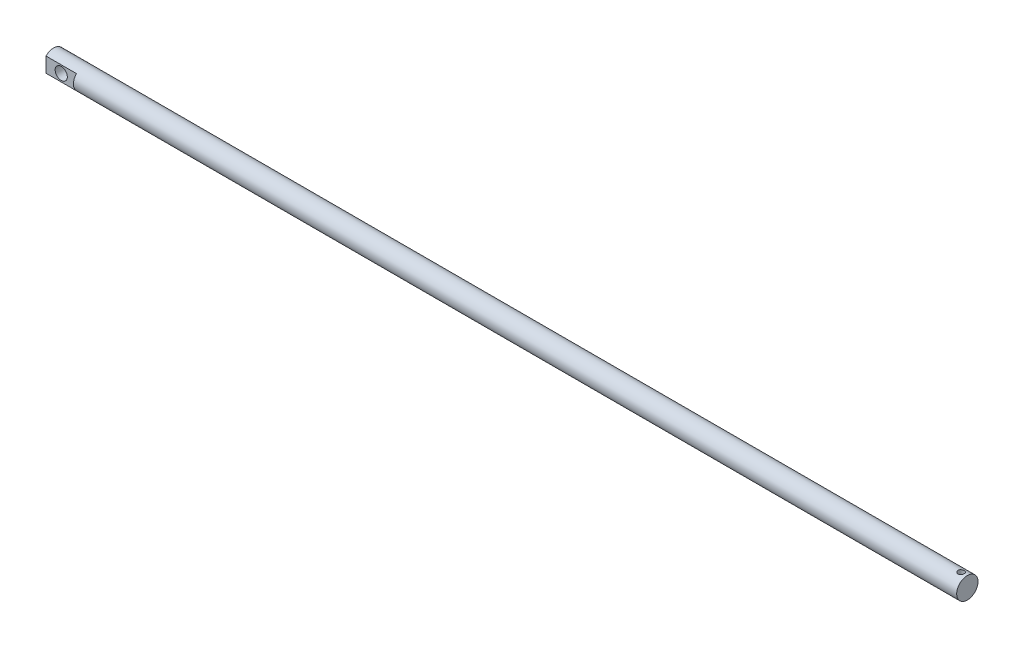
ISO-10303-21;
HEADER;
FILE_DESCRIPTION(('STEP AP214'),'2;1');
FILE_NAME('part.step','',(''),(''),'','','');
FILE_SCHEMA(('AUTOMOTIVE_DESIGN { 1 0 10303 214 1 1 1 1 }'));
ENDSEC;
DATA;
#1=APPLICATION_CONTEXT('core data for automotive mechanical design processes');
#2=APPLICATION_PROTOCOL_DEFINITION('international standard','automotive_design',2000,#1);
#3=PRODUCT_CONTEXT('',#1,'mechanical');
#4=PRODUCT('Part','Part','',(#3));
#5=PRODUCT_RELATED_PRODUCT_CATEGORY('part','',(#4));
#6=PRODUCT_DEFINITION_FORMATION('','',#4);
#7=PRODUCT_DEFINITION_CONTEXT('part definition',#1,'design');
#8=PRODUCT_DEFINITION('design','',#6,#7);
#9=PRODUCT_DEFINITION_SHAPE('','',#8);
#10=(LENGTH_UNIT() NAMED_UNIT(*) SI_UNIT(.MILLI.,.METRE.));
#11=(NAMED_UNIT(*) PLANE_ANGLE_UNIT() SI_UNIT($,.RADIAN.));
#12=(NAMED_UNIT(*) SI_UNIT($,.STERADIAN.) SOLID_ANGLE_UNIT());
#13=UNCERTAINTY_MEASURE_WITH_UNIT(LENGTH_MEASURE(1.E-05),#10,'distance_accuracy_value','');
#14=(GEOMETRIC_REPRESENTATION_CONTEXT(3) GLOBAL_UNCERTAINTY_ASSIGNED_CONTEXT((#13)) GLOBAL_UNIT_ASSIGNED_CONTEXT((#10,
#11,#12)) REPRESENTATION_CONTEXT('',''));
#15=CARTESIAN_POINT('',(0.,0.,0.));
#16=DIRECTION('',(0.,0.,1.));
#17=DIRECTION('',(1.,0.,0.));
#18=AXIS2_PLACEMENT_3D('',#15,#16,#17);
#19=CARTESIAN_POINT('',(600.,0.,0.));
#20=DIRECTION('',(-1.,0.,0.));
#21=DIRECTION('',(0.,0.,1.));
#22=AXIS2_PLACEMENT_3D('',#19,#20,#21);
#23=CYLINDRICAL_SURFACE('',#22,7.);
#24=CARTESIAN_POINT('',(593.999999999999,-7.,0.));
#25=CARTESIAN_POINT('',(594.000001939561,-6.99999869294341,0.109954902377268));
#26=CARTESIAN_POINT('',(594.009097788976,-6.99738417402043,0.219929747872615));
#27=CARTESIAN_POINT('',(594.045164270102,-6.98720905945103,0.436691991197052));
#28=CARTESIAN_POINT('',(594.072141666074,-6.97964659210084,0.543478166829692));
#29=CARTESIAN_POINT('',(594.143008038416,-6.96040691349072,0.75070430073796));
#30=CARTESIAN_POINT('',(594.186873436151,-6.9487354410634,0.851152880848314));
#31=CARTESIAN_POINT('',(594.290177991478,-6.92249978316542,1.04326876112939));
#32=CARTESIAN_POINT('',(594.34961877849,-6.9079352950802,1.1349351411783));
#33=CARTESIAN_POINT('',(594.484035010672,-6.87704734625576,1.30929444685912));
#34=CARTESIAN_POINT('',(594.559344753855,-6.86069041945187,1.39172372238114));
#35=CARTESIAN_POINT('',(594.722647743137,-6.82826734915636,1.54297135792458));
#36=CARTESIAN_POINT('',(594.810642887632,-6.81220124959338,1.61178767707806));
#37=CARTESIAN_POINT('',(594.99899358279,-6.78183014875381,1.73519790006457));
#38=CARTESIAN_POINT('',(595.099561985064,-6.7675670250601,1.78947821103377));
#39=CARTESIAN_POINT('',(595.30887201175,-6.74291343840659,1.8802517055401));
#40=CARTESIAN_POINT('',(595.417611872071,-6.73252214244863,1.91674871555749));
#41=CARTESIAN_POINT('',(595.637234763165,-6.71713608196007,1.96998433013906));
#42=CARTESIAN_POINT('',(595.747991362767,-6.71200978570002,1.98720553202881));
#43=CARTESIAN_POINT('',(595.970931148446,-6.70734208201985,2.00290667789217));
#44=CARTESIAN_POINT('',(596.08311401925,-6.70779946107602,2.00139069409654));
#45=CARTESIAN_POINT('',(596.301868611456,-6.71413034409924,1.98004134762936));
#46=CARTESIAN_POINT('',(596.408504351181,-6.71982782697927,1.96080325728423));
#47=CARTESIAN_POINT('',(596.616967219627,-6.73571348382802,1.9055138608582));
#48=CARTESIAN_POINT('',(596.71879391272,-6.74590206376395,1.8694610348128));
#49=CARTESIAN_POINT('',(596.916246244432,-6.76976863516072,1.78110681137842));
#50=CARTESIAN_POINT('',(597.011777072402,-6.78348916405641,1.72860551172911));
#51=CARTESIAN_POINT('',(597.192876561213,-6.81285216882052,1.60898379167916));
#52=CARTESIAN_POINT('',(597.278442997735,-6.82849507221905,1.54186011673376));
#53=CARTESIAN_POINT('',(597.440572375606,-6.8606625065635,1.3919039967305));
#54=CARTESIAN_POINT('',(597.516674475967,-6.87719804572361,1.30857487484559));
#55=CARTESIAN_POINT('',(597.65392600364,-6.90876247218341,1.13013228238645));
#56=CARTESIAN_POINT('',(597.715074656042,-6.92379128137822,1.03501820148211));
#57=CARTESIAN_POINT('',(597.820928734774,-6.95076528065499,0.834923073091647));
#58=CARTESIAN_POINT('',(597.865540286804,-6.96269275497227,0.729889817810184));
#59=CARTESIAN_POINT('',(597.936333891417,-6.98199251487584,0.513393229967602));
#60=CARTESIAN_POINT('',(597.962520589245,-6.98936594856255,0.401931525810254));
#61=CARTESIAN_POINT('',(597.99497328571,-6.99854874514672,0.179666388644417));
#62=CARTESIAN_POINT('',(598.001864695373,-7.00053272850599,0.0689613468605594));
#63=CARTESIAN_POINT('',(597.997272733699,-6.99922084707091,-0.152026526805571));
#64=CARTESIAN_POINT('',(597.985791567154,-6.99592561580629,-0.262309407757119));
#65=CARTESIAN_POINT('',(597.945289555684,-6.98453926685206,-0.477018633430354));
#66=CARTESIAN_POINT('',(597.916626818677,-6.97654613017679,-0.581518211734887));
#67=CARTESIAN_POINT('',(597.842999498015,-6.95667998741883,-0.784208686205712));
#68=CARTESIAN_POINT('',(597.798033029111,-6.94480653265873,-0.882398851248811));
#69=CARTESIAN_POINT('',(597.691976663355,-6.91809961169143,-1.07204168512015));
#70=CARTESIAN_POINT('',(597.630558801175,-6.90320763178338,-1.16330248654021));
#71=CARTESIAN_POINT('',(597.493747494049,-6.87217947098438,-1.33443852805963));
#72=CARTESIAN_POINT('',(597.418350869935,-6.85604300755104,-1.41431117084322));
#73=CARTESIAN_POINT('',(597.252790657951,-6.82368619629438,-1.56310642834029));
#74=CARTESIAN_POINT('',(597.162224724441,-6.807480368583,-1.63158542740736));
#75=CARTESIAN_POINT('',(596.970537411375,-6.7773889473478,-1.75239531606781));
#76=CARTESIAN_POINT('',(596.869416399229,-6.76350327310601,-1.80472676748696));
#77=CARTESIAN_POINT('',(596.659908789025,-6.73978651242828,-1.89137454118307));
#78=CARTESIAN_POINT('',(596.551564236502,-6.72993400029426,-1.92578633239682));
#79=CARTESIAN_POINT('',(596.330290064425,-6.71542456669517,-1.975794500679));
#80=CARTESIAN_POINT('',(596.217361844924,-6.71076607094357,-1.99139657901618));
#81=CARTESIAN_POINT('',(595.994703967063,-6.70731703127609,-2.00298024246883));
#82=CARTESIAN_POINT('',(595.885014495443,-6.70831160808093,-1.99968027644437));
#83=CARTESIAN_POINT('',(595.667825269338,-6.71554597206092,-1.97524710957499));
#84=CARTESIAN_POINT('',(595.560325441908,-6.72178558421104,-1.95411450379907));
#85=CARTESIAN_POINT('',(595.351621628831,-6.73866977160517,-1.8950596881671));
#86=CARTESIAN_POINT('',(595.250364612989,-6.74926877048965,-1.85731091786399));
#87=CARTESIAN_POINT('',(595.055541265507,-6.77367302842104,-1.76622949301612));
#88=CARTESIAN_POINT('',(594.961976298726,-6.78747885482384,-1.71289408043182));
#89=CARTESIAN_POINT('',(594.781816478194,-6.81731668949928,-1.59006546534855));
#90=CARTESIAN_POINT('',(594.695558608658,-6.83340763179058,-1.52009227722758));
#91=CARTESIAN_POINT('',(594.53577610419,-6.86569845092227,-1.36685984037957));
#92=CARTESIAN_POINT('',(594.462254680889,-6.88189835417164,-1.28359725072877));
#93=CARTESIAN_POINT('',(594.328162815673,-6.91307959572361,-1.10357432086559));
#94=CARTESIAN_POINT('',(594.26797301273,-6.9280190103741,-1.00652250235999));
#95=CARTESIAN_POINT('',(594.164854214978,-6.95451395777968,-0.803250529646877));
#96=CARTESIAN_POINT('',(594.121915788067,-6.96607133870285,-0.697035424114947));
#97=CARTESIAN_POINT('',(594.059152448604,-6.98327344725306,-0.492916315335206));
#98=CARTESIAN_POINT('',(594.037026463315,-6.98949684362076,-0.395763007624532));
#99=CARTESIAN_POINT('',(594.007450342757,-6.99786043852147,-0.199078368786442));
#100=CARTESIAN_POINT('',(593.999998244023,-7.00000118333996,-0.0995473576161286));
#101=CARTESIAN_POINT('',(593.999999999999,-7.,0.));
#102=B_SPLINE_CURVE_WITH_KNOTS('',3,(#24,#25,#26,#27,#28,#29,#30,#31,#32,#33,#34,#35,#36,#37,
#38,#39,#40,#41,#42,#43,#44,#45,#46,#47,#48,#49,#50,#51,#52,#53,#54,#55,#56,#57,#58,#59,#60,#61,
#62,#63,#64,#65,#66,#67,#68,#69,#70,#71,#72,#73,#74,#75,#76,#77,#78,#79,#80,#81,#82,#83,#84,#85,
#86,#87,#88,#89,#90,#91,#92,#93,#94,#95,#96,#97,#98,#99,#100,#101),.UNSPECIFIED.,.T.,.F.,(4,2,2,
2,2,2,2,2,2,2,2,2,2,2,2,2,2,2,2,2,2,2,2,2,2,2,2,2,2,2,2,2,2,2,2,2,2,2,4),(0.,0.329499312542394,
0.659123339795276,0.988288812895436,1.31748873543533,1.65447811530804,1.99151797873739,
2.33533075300099,2.6790695154485,3.0139950986279,3.34884789231284,3.67284785829393,
3.99687711786186,4.32500803291267,4.65321205577406,4.99378500602575,5.33437560155527,
5.67687101104534,6.01928004014705,6.35045457698299,6.68158937434751,7.00605140479629,
7.33055096575641,7.66207525344566,7.99367503187908,8.33612104884465,8.6785551496543,
9.01914573366266,9.35963305787878,9.68726681616629,10.0148896418612,10.3391709629142,
10.6635096999774,10.9986765689054,11.3339278310866,11.6777797897034,12.0214434923427,
12.3197946803814,12.6181059442792),.UNSPECIFIED.);
#103=CARTESIAN_POINT('',(593.999999999999,-7.,0.));
#104=VERTEX_POINT('',#103);
#105=EDGE_CURVE('E12',#104,#104,#102,.T.);
#106=ORIENTED_EDGE('',*,*,#105,.T.);
#107=EDGE_LOOP('',(#106));
#108=FACE_BOUND('',#107,.T.);
#109=CARTESIAN_POINT('',(593.999999999999,6.99999999999974,0.));
#110=CARTESIAN_POINT('',(594.000001939561,6.99999869294314,-0.109954902377272));
#111=CARTESIAN_POINT('',(594.009097788976,6.99738417402035,-0.219929747872623));
#112=CARTESIAN_POINT('',(594.045164270102,6.9872090594511,-0.436691991197063));
#113=CARTESIAN_POINT('',(594.072141666074,6.97964659210085,-0.543478166829702));
#114=CARTESIAN_POINT('',(594.143008038416,6.9604069134907,-0.75070430073797));
#115=CARTESIAN_POINT('',(594.186873436151,6.94873544106339,-0.851152880848326));
#116=CARTESIAN_POINT('',(594.290177991478,6.92249978316542,-1.04326876112941));
#117=CARTESIAN_POINT('',(594.34961877849,6.9079352950802,-1.13493514117833));
#118=CARTESIAN_POINT('',(594.484035010672,6.87704734625576,-1.30929444685915));
#119=CARTESIAN_POINT('',(594.559344753855,6.86069041945186,-1.39172372238116));
#120=CARTESIAN_POINT('',(594.722647743137,6.82826734915636,-1.54297135792458));
#121=CARTESIAN_POINT('',(594.810642887632,6.81220124959338,-1.61178767707807));
#122=CARTESIAN_POINT('',(594.99899358279,6.78183014875381,-1.73519790006457));
#123=CARTESIAN_POINT('',(595.099561985064,6.7675670250601,-1.78947821103377));
#124=CARTESIAN_POINT('',(595.30887201175,6.74291343840659,-1.8802517055401));
#125=CARTESIAN_POINT('',(595.417611872071,6.73252214244863,-1.91674871555749));
#126=CARTESIAN_POINT('',(595.637234763165,6.71713608196007,-1.96998433013906));
#127=CARTESIAN_POINT('',(595.747991362767,6.71200978570002,-1.98720553202881));
#128=CARTESIAN_POINT('',(595.970931148446,6.70734208201985,-2.00290667789217));
#129=CARTESIAN_POINT('',(596.08311401925,6.70779946107602,-2.00139069409653));
#130=CARTESIAN_POINT('',(596.301868611456,6.71413034409924,-1.98004134762935));
#131=CARTESIAN_POINT('',(596.408504351181,6.71982782697927,-1.96080325728423));
#132=CARTESIAN_POINT('',(596.616967219627,6.73571348382802,-1.9055138608582));
#133=CARTESIAN_POINT('',(596.71879391272,6.74590206376395,-1.8694610348128));
#134=CARTESIAN_POINT('',(596.916246244432,6.76976863516072,-1.78110681137842));
#135=CARTESIAN_POINT('',(597.011777072402,6.78348916405641,-1.72860551172912));
#136=CARTESIAN_POINT('',(597.192876561213,6.81285216882052,-1.60898379167915));
#137=CARTESIAN_POINT('',(597.278442997735,6.82849507221905,-1.54186011673376));
#138=CARTESIAN_POINT('',(597.440572375606,6.86066250656349,-1.39190399673052));
#139=CARTESIAN_POINT('',(597.516674475967,6.8771980457236,-1.30857487484563));
#140=CARTESIAN_POINT('',(597.65392600364,6.9087624721834,-1.13013228238649));
#141=CARTESIAN_POINT('',(597.715074656042,6.92379128137822,-1.03501820148213));
#142=CARTESIAN_POINT('',(597.820928734774,6.95076528065499,-0.834923073091639));
#143=CARTESIAN_POINT('',(597.865540286804,6.96269275497227,-0.729889817810179));
#144=CARTESIAN_POINT('',(597.936333891417,6.98199251487584,-0.513393229967596));
#145=CARTESIAN_POINT('',(597.962520589245,6.98936594856255,-0.401931525810245));
#146=CARTESIAN_POINT('',(597.99497328571,6.99854874514672,-0.179666388644405));
#147=CARTESIAN_POINT('',(598.001864695373,7.00053272850599,-0.068961346860546));
#148=CARTESIAN_POINT('',(597.997272733699,6.99922084707091,0.152026526805586));
#149=CARTESIAN_POINT('',(597.985791567154,6.99592561580629,0.262309407757136));
#150=CARTESIAN_POINT('',(597.945289555684,6.98453926685206,0.477018633430373));
#151=CARTESIAN_POINT('',(597.916626818677,6.97654613017679,0.581518211734908));
#152=CARTESIAN_POINT('',(597.842999498015,6.95667998741882,0.784208686205738));
#153=CARTESIAN_POINT('',(597.798033029111,6.94480653265872,0.882398851248841));
#154=CARTESIAN_POINT('',(597.691976663355,6.91809961169143,1.07204168512018));
#155=CARTESIAN_POINT('',(597.630558801175,6.90320763178338,1.16330248654023));
#156=CARTESIAN_POINT('',(597.493747494049,6.87217947098438,1.33443852805964));
#157=CARTESIAN_POINT('',(597.418350869935,6.85604300755104,1.41431117084323));
#158=CARTESIAN_POINT('',(597.252790657951,6.82368619629438,1.56310642834029));
#159=CARTESIAN_POINT('',(597.162224724441,6.80748036858299,1.63158542740736));
#160=CARTESIAN_POINT('',(596.970537411375,6.7773889473478,1.75239531606781));
#161=CARTESIAN_POINT('',(596.869416399229,6.76350327310601,1.80472676748696));
#162=CARTESIAN_POINT('',(596.659908789025,6.73978651242828,1.89137454118307));
#163=CARTESIAN_POINT('',(596.551564236502,6.72993400029426,1.92578633239682));
#164=CARTESIAN_POINT('',(596.330290064425,6.71542456669517,1.975794500679));
#165=CARTESIAN_POINT('',(596.217361844924,6.71076607094357,1.99139657901618));
#166=CARTESIAN_POINT('',(595.994703967063,6.70731703127609,2.00298024246883));
#167=CARTESIAN_POINT('',(595.885014495443,6.70831160808093,1.99968027644437));
#168=CARTESIAN_POINT('',(595.667825269338,6.71554597206093,1.97524710957498));
#169=CARTESIAN_POINT('',(595.560325441908,6.72178558421105,1.95411450379904));
#170=CARTESIAN_POINT('',(595.351621628831,6.73866977160519,1.89505968816704));
#171=CARTESIAN_POINT('',(595.250364612988,6.74926877048966,1.85731091786393));
#172=CARTESIAN_POINT('',(595.055541265507,6.77367302842105,1.76622949301608));
#173=CARTESIAN_POINT('',(594.961976298726,6.78747885482385,1.7128940804318));
#174=CARTESIAN_POINT('',(594.781816478194,6.81731668949928,1.59006546534855));
#175=CARTESIAN_POINT('',(594.695558608658,6.83340763179058,1.52009227722757));
#176=CARTESIAN_POINT('',(594.53577610419,6.86569845092227,1.36685984037957));
#177=CARTESIAN_POINT('',(594.462254680889,6.88189835417164,1.28359725072877));
#178=CARTESIAN_POINT('',(594.328162815673,6.91307959572362,1.10357432086557));
#179=CARTESIAN_POINT('',(594.26797301273,6.92801901037411,1.00652250235994));
#180=CARTESIAN_POINT('',(594.164854214978,6.95451395777969,0.803250529646806));
#181=CARTESIAN_POINT('',(594.121915788067,6.96607133870284,0.697035424114884));
#182=CARTESIAN_POINT('',(594.059152448604,6.98327344725309,0.492916315335162));
#183=CARTESIAN_POINT('',(594.037026463315,6.98949684362082,0.3957630076245));
#184=CARTESIAN_POINT('',(594.007450342757,6.99786043852141,0.199078368786428));
#185=CARTESIAN_POINT('',(593.999998244023,7.00000118333971,0.0995473576161219));
#186=CARTESIAN_POINT('',(593.999999999999,6.99999999999974,0.));
#187=B_SPLINE_CURVE_WITH_KNOTS('',3,(#109,#110,#111,#112,#113,#114,#115,#116,#117,#118,#119,
#120,#121,#122,#123,#124,#125,#126,#127,#128,#129,#130,#131,#132,#133,#134,#135,#136,#137,#138,
#139,#140,#141,#142,#143,#144,#145,#146,#147,#148,#149,#150,#151,#152,#153,#154,#155,#156,#157,
#158,#159,#160,#161,#162,#163,#164,#165,#166,#167,#168,#169,#170,#171,#172,#173,#174,#175,#176,
#177,#178,#179,#180,#181,#182,#183,#184,#185,#186),.UNSPECIFIED.,.T.,.F.,(4,2,2,2,2,2,2,2,2,2,2,
2,2,2,2,2,2,2,2,2,2,2,2,2,2,2,2,2,2,2,2,2,2,2,2,2,2,2,4),(0.,0.329499312542399,
0.659123339795279,0.988288812895446,1.31748873543536,1.65447811530804,1.99151797873739,
2.33533075300099,2.6790695154485,3.0139950986279,3.34884789231284,3.67284785829393,
3.99687711786186,4.32500803291267,4.65321205577406,4.99378500602571,5.33437560155527,
5.67687101104535,6.01928004014706,6.350454576983,6.68158937434753,7.00605140479632,
7.33055096575645,7.66207525344567,7.99367503187909,8.33612104884466,8.67855514965431,
9.01914573366267,9.35963305787879,9.6872668161663,10.0148896418615,10.3391709629144,
10.6635096999775,10.9986765689054,11.3339278310866,11.6777797897035,12.0214434923427,
12.3197946803814,12.6181059442792),.UNSPECIFIED.);
#188=CARTESIAN_POINT('',(593.999999999999,6.99999999999974,0.));
#189=VERTEX_POINT('',#188);
#190=EDGE_CURVE('E47',#189,#189,#187,.T.);
#191=ORIENTED_EDGE('',*,*,#190,.T.);
#192=EDGE_LOOP('',(#191));
#193=FACE_BOUND('',#192,.T.);
#194=CARTESIAN_POINT('',(600.,0.,0.));
#195=DIRECTION('',(1.,0.,0.));
#196=DIRECTION('',(0.,0.,-1.));
#197=AXIS2_PLACEMENT_3D('',#194,#195,#196);
#198=CIRCLE('',#197,7.);
#199=CARTESIAN_POINT('',(600.,0.,-7.));
#200=VERTEX_POINT('',#199);
#201=EDGE_CURVE('E89',#200,#200,#198,.T.);
#202=ORIENTED_EDGE('',*,*,#201,.F.);
#203=EDGE_LOOP('',(#202));
#204=FACE_BOUND('',#203,.T.);
#205=DIRECTION('',(-1.,0.,0.));
#206=VECTOR('',#205,1.);
#207=CARTESIAN_POINT('',(600.,4.89897948556636,5.));
#208=LINE('',#207,#206);
#209=CARTESIAN_POINT('',(20.,4.89897948556636,5.));
#210=VERTEX_POINT('',#209);
#211=CARTESIAN_POINT('',(0.,4.89897948556636,5.));
#212=VERTEX_POINT('',#211);
#213=EDGE_CURVE('E62',#210,#212,#208,.T.);
#214=ORIENTED_EDGE('',*,*,#213,.F.);
#215=CARTESIAN_POINT('',(20.,0.,0.));
#216=DIRECTION('',(-1.,0.,0.));
#217=DIRECTION('',(0.,0.,1.));
#218=AXIS2_PLACEMENT_3D('',#215,#216,#217);
#219=CIRCLE('',#218,7.);
#220=CARTESIAN_POINT('',(20.,-4.89897948556635,5.));
#221=VERTEX_POINT('',#220);
#222=EDGE_CURVE('E107',#221,#210,#219,.T.);
#223=ORIENTED_EDGE('',*,*,#222,.F.);
#224=DIRECTION('',(-1.,0.,0.));
#225=VECTOR('',#224,1.);
#226=CARTESIAN_POINT('',(600.,-4.89897948556635,5.));
#227=LINE('',#226,#225);
#228=CARTESIAN_POINT('',(0.,-4.89897948556635,5.));
#229=VERTEX_POINT('',#228);
#230=EDGE_CURVE('E208',#229,#221,#227,.F.);
#231=ORIENTED_EDGE('',*,*,#230,.F.);
#232=CARTESIAN_POINT('',(0.,0.,0.));
#233=DIRECTION('',(1.,0.,0.));
#234=DIRECTION('',(0.,0.,-1.));
#235=AXIS2_PLACEMENT_3D('',#232,#233,#234);
#236=CIRCLE('',#235,7.);
#237=CARTESIAN_POINT('',(0.,-4.89897948556636,-5.));
#238=VERTEX_POINT('',#237);
#239=EDGE_CURVE('E99',#229,#238,#236,.T.);
#240=ORIENTED_EDGE('',*,*,#239,.T.);
#241=DIRECTION('',(-1.,0.,0.));
#242=VECTOR('',#241,1.);
#243=CARTESIAN_POINT('',(600.,-4.89897948556636,-5.));
#244=LINE('',#243,#242);
#245=CARTESIAN_POINT('',(20.,-4.89897948556636,-5.));
#246=VERTEX_POINT('',#245);
#247=EDGE_CURVE('E54',#246,#238,#244,.T.);
#248=ORIENTED_EDGE('',*,*,#247,.F.);
#249=CARTESIAN_POINT('',(20.,4.89897948556636,-5.));
#250=VERTEX_POINT('',#249);
#251=EDGE_CURVE('E95',#250,#246,#219,.T.);
#252=ORIENTED_EDGE('',*,*,#251,.F.);
#253=DIRECTION('',(-1.,0.,0.));
#254=VECTOR('',#253,1.);
#255=CARTESIAN_POINT('',(600.,4.89897948556636,-5.));
#256=LINE('',#255,#254);
#257=CARTESIAN_POINT('',(0.,4.89897948556636,-5.));
#258=VERTEX_POINT('',#257);
#259=EDGE_CURVE('E82',#258,#250,#256,.F.);
#260=ORIENTED_EDGE('',*,*,#259,.F.);
#261=EDGE_CURVE('E94',#258,#212,#236,.T.);
#262=ORIENTED_EDGE('',*,*,#261,.T.);
#263=EDGE_LOOP('',(#214,#223,#231,#240,#248,#252,#260,#262));
#264=FACE_BOUND('',#263,.T.);
#265=ADVANCED_FACE('F36',(#108,#193,#204,#264),#23,.T.);
#266=CARTESIAN_POINT('',(0.,0.,0.));
#267=DIRECTION('',(1.,0.,0.));
#268=DIRECTION('',(0.,0.,-1.));
#269=AXIS2_PLACEMENT_3D('',#266,#267,#268);
#270=PLANE('',#269);
#271=DIRECTION('',(0.,-1.,0.));
#272=VECTOR('',#271,1.);
#273=CARTESIAN_POINT('',(0.,0.,5.));
#274=LINE('',#273,#272);
#275=EDGE_CURVE('E88',#212,#229,#274,.T.);
#276=ORIENTED_EDGE('',*,*,#275,.F.);
#277=ORIENTED_EDGE('',*,*,#261,.F.);
#278=DIRECTION('',(0.,1.,0.));
#279=VECTOR('',#278,1.);
#280=CARTESIAN_POINT('',(0.,0.,-5.));
#281=LINE('',#280,#279);
#282=EDGE_CURVE('E79',#238,#258,#281,.T.);
#283=ORIENTED_EDGE('',*,*,#282,.F.);
#284=ORIENTED_EDGE('',*,*,#239,.F.);
#285=EDGE_LOOP('',(#276,#277,#283,#284));
#286=FACE_BOUND('',#285,.T.);
#287=ADVANCED_FACE('F98',(#286),#270,.F.);
#288=CARTESIAN_POINT('',(600.,0.,0.));
#289=DIRECTION('',(1.,0.,0.));
#290=DIRECTION('',(0.,0.,-1.));
#291=AXIS2_PLACEMENT_3D('',#288,#289,#290);
#292=PLANE('',#291);
#293=ORIENTED_EDGE('',*,*,#201,.T.);
#294=EDGE_LOOP('',(#293));
#295=FACE_BOUND('',#294,.T.);
#296=ADVANCED_FACE('F129',(#295),#292,.T.);
#297=CARTESIAN_POINT('',(20.,10.,-5.));
#298=DIRECTION('',(0.,0.,-1.));
#299=DIRECTION('',(0.,1.,0.));
#300=AXIS2_PLACEMENT_3D('',#297,#298,#299);
#301=PLANE('',#300);
#302=CARTESIAN_POINT('',(10.,0.,-5.));
#303=DIRECTION('',(0.,0.,-1.));
#304=DIRECTION('',(0.,1.,0.));
#305=AXIS2_PLACEMENT_3D('',#302,#303,#304);
#306=CIRCLE('',#305,4.);
#307=CARTESIAN_POINT('',(10.,4.,-5.));
#308=VERTEX_POINT('',#307);
#309=EDGE_CURVE('E111',#308,#308,#306,.T.);
#310=ORIENTED_EDGE('',*,*,#309,.F.);
#311=EDGE_LOOP('',(#310));
#312=FACE_BOUND('',#311,.T.);
#313=ORIENTED_EDGE('',*,*,#247,.T.);
#314=ORIENTED_EDGE('',*,*,#282,.T.);
#315=ORIENTED_EDGE('',*,*,#259,.T.);
#316=DIRECTION('',(0.,-1.,0.));
#317=VECTOR('',#316,1.);
#318=CARTESIAN_POINT('',(20.,10.,-5.));
#319=LINE('',#318,#317);
#320=EDGE_CURVE('E96',#250,#246,#319,.T.);
#321=ORIENTED_EDGE('',*,*,#320,.T.);
#322=EDGE_LOOP('',(#313,#314,#315,#321));
#323=FACE_BOUND('',#322,.T.);
#324=ADVANCED_FACE('F81',(#312,#323),#301,.T.);
#325=CARTESIAN_POINT('',(20.,0.,0.));
#326=DIRECTION('',(-1.,0.,0.));
#327=DIRECTION('',(0.,0.,1.));
#328=AXIS2_PLACEMENT_3D('',#325,#326,#327);
#329=PLANE('',#328);
#330=ORIENTED_EDGE('',*,*,#251,.T.);
#331=ORIENTED_EDGE('',*,*,#320,.F.);
#332=EDGE_LOOP('',(#330,#331));
#333=FACE_BOUND('',#332,.T.);
#334=ADVANCED_FACE('F128',(#333),#329,.T.);
#335=ORIENTED_EDGE('',*,*,#222,.T.);
#336=DIRECTION('',(0.,1.,0.));
#337=VECTOR('',#336,1.);
#338=CARTESIAN_POINT('',(20.,10.,5.));
#339=LINE('',#338,#337);
#340=EDGE_CURVE('E110',#221,#210,#339,.T.);
#341=ORIENTED_EDGE('',*,*,#340,.F.);
#342=EDGE_LOOP('',(#335,#341));
#343=FACE_BOUND('',#342,.T.);
#344=ADVANCED_FACE('F133',(#343),#329,.T.);
#345=CARTESIAN_POINT('',(20.,10.,5.));
#346=DIRECTION('',(0.,0.,1.));
#347=DIRECTION('',(0.,-1.,0.));
#348=AXIS2_PLACEMENT_3D('',#345,#346,#347);
#349=PLANE('',#348);
#350=CARTESIAN_POINT('',(10.,0.,5.));
#351=DIRECTION('',(0.,0.,1.));
#352=DIRECTION('',(0.,-1.,0.));
#353=AXIS2_PLACEMENT_3D('',#350,#351,#352);
#354=CIRCLE('',#353,4.);
#355=CARTESIAN_POINT('',(10.,-4.,5.));
#356=VERTEX_POINT('',#355);
#357=EDGE_CURVE('E108',#356,#356,#354,.T.);
#358=ORIENTED_EDGE('',*,*,#357,.F.);
#359=EDGE_LOOP('',(#358));
#360=FACE_BOUND('',#359,.T.);
#361=ORIENTED_EDGE('',*,*,#213,.T.);
#362=ORIENTED_EDGE('',*,*,#275,.T.);
#363=ORIENTED_EDGE('',*,*,#230,.T.);
#364=ORIENTED_EDGE('',*,*,#340,.T.);
#365=EDGE_LOOP('',(#361,#362,#363,#364));
#366=FACE_BOUND('',#365,.T.);
#367=ADVANCED_FACE('F124',(#360,#366),#349,.T.);
#368=CARTESIAN_POINT('',(10.,0.,15.));
#369=DIRECTION('',(0.,0.,-1.));
#370=DIRECTION('',(0.,1.,0.));
#371=AXIS2_PLACEMENT_3D('',#368,#369,#370);
#372=CYLINDRICAL_SURFACE('',#371,4.);
#373=ORIENTED_EDGE('',*,*,#357,.T.);
#374=EDGE_LOOP('',(#373));
#375=FACE_BOUND('',#374,.T.);
#376=ORIENTED_EDGE('',*,*,#309,.T.);
#377=EDGE_LOOP('',(#376));
#378=FACE_BOUND('',#377,.T.);
#379=ADVANCED_FACE('F119',(#375,#378),#372,.F.);
#380=CARTESIAN_POINT('',(596.,-7.00000000000003,0.));
#381=DIRECTION('',(0.,1.,0.));
#382=DIRECTION('',(-1.,0.,0.));
#383=AXIS2_PLACEMENT_3D('',#380,#381,#382);
#384=CYLINDRICAL_SURFACE('',#383,2.00000000000032);
#385=ORIENTED_EDGE('',*,*,#190,.F.);
#386=EDGE_LOOP('',(#385));
#387=FACE_BOUND('',#386,.T.);
#388=ORIENTED_EDGE('',*,*,#105,.F.);
#389=EDGE_LOOP('',(#388));
#390=FACE_BOUND('',#389,.T.);
#391=ADVANCED_FACE('F115',(#387,#390),#384,.F.);
#392=CLOSED_SHELL('',(#265,#287,#296,#324,#334,#344,#367,#379,#391));
#393=MANIFOLD_SOLID_BREP('B2',#392);
#394=ADVANCED_BREP_SHAPE_REPRESENTATION('',(#18,#393),#14);
#395=SHAPE_DEFINITION_REPRESENTATION(#9,#394);
ENDSEC;
END-ISO-10303-21;
